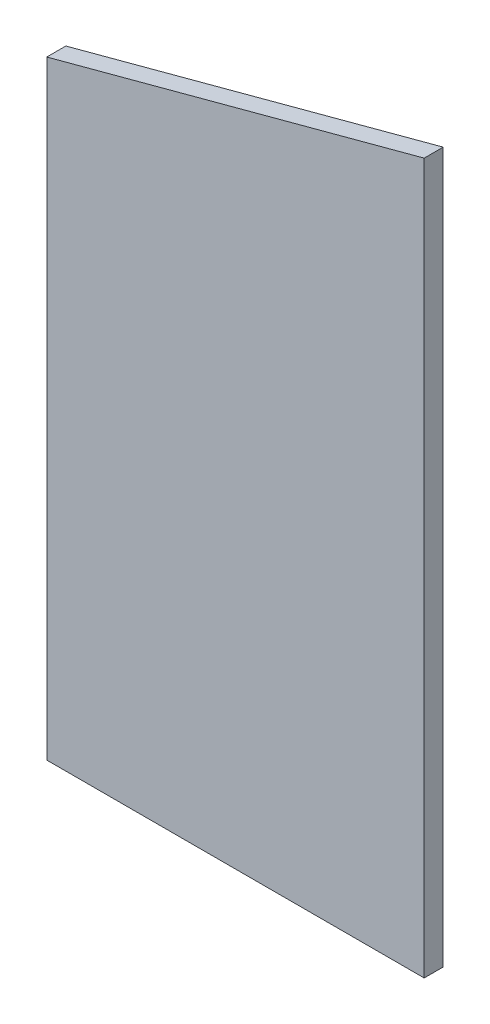
ISO-10303-21;
HEADER;
FILE_DESCRIPTION(('STEP AP214'),'2;1');
FILE_NAME('part.step','',(''),(''),'','','');
FILE_SCHEMA(('AUTOMOTIVE_DESIGN { 1 0 10303 214 1 1 1 1 }'));
ENDSEC;
DATA;
#1=APPLICATION_CONTEXT('core data for automotive mechanical design processes');
#2=APPLICATION_PROTOCOL_DEFINITION('international standard','automotive_design',2000,#1);
#3=PRODUCT_CONTEXT('',#1,'mechanical');
#4=PRODUCT('Part','Part','',(#3));
#5=PRODUCT_RELATED_PRODUCT_CATEGORY('part','',(#4));
#6=PRODUCT_DEFINITION_FORMATION('','',#4);
#7=PRODUCT_DEFINITION_CONTEXT('part definition',#1,'design');
#8=PRODUCT_DEFINITION('design','',#6,#7);
#9=PRODUCT_DEFINITION_SHAPE('','',#8);
#10=(LENGTH_UNIT() NAMED_UNIT(*) SI_UNIT(.MILLI.,.METRE.));
#11=(NAMED_UNIT(*) PLANE_ANGLE_UNIT() SI_UNIT($,.RADIAN.));
#12=(NAMED_UNIT(*) SI_UNIT($,.STERADIAN.) SOLID_ANGLE_UNIT());
#13=UNCERTAINTY_MEASURE_WITH_UNIT(LENGTH_MEASURE(1.E-05),#10,'distance_accuracy_value','');
#14=(GEOMETRIC_REPRESENTATION_CONTEXT(3) GLOBAL_UNCERTAINTY_ASSIGNED_CONTEXT((#13)) GLOBAL_UNIT_ASSIGNED_CONTEXT((#10,
#11,#12)) REPRESENTATION_CONTEXT('',''));
#15=CARTESIAN_POINT('',(0.,0.,0.));
#16=DIRECTION('',(0.,0.,1.));
#17=DIRECTION('',(1.,0.,0.));
#18=AXIS2_PLACEMENT_3D('',#15,#16,#17);
#19=CARTESIAN_POINT('',(0.,0.,-11.90625));
#20=DIRECTION('',(0.,0.,-1.));
#21=DIRECTION('',(-1.,0.,0.));
#22=AXIS2_PLACEMENT_3D('',#19,#20,#21);
#23=PLANE('',#22);
#24=DIRECTION('',(1.,0.,0.));
#25=VECTOR('',#24,1.);
#26=CARTESIAN_POINT('',(-583.900187924995,11.90625,-11.90625));
#27=LINE('',#26,#25);
#28=CARTESIAN_POINT('',(-819.830594651005,11.90625,-11.90625));
#29=VERTEX_POINT('',#28);
#30=CARTESIAN_POINT('',(-583.900187924995,11.90625,-11.90625));
#31=VERTEX_POINT('',#30);
#32=EDGE_CURVE('E36',#29,#31,#27,.T.);
#33=ORIENTED_EDGE('',*,*,#32,.F.);
#34=DIRECTION('',(0.,-1.,0.));
#35=VECTOR('',#34,1.);
#36=CARTESIAN_POINT('',(-819.830594651005,11.90625,-11.90625));
#37=LINE('',#36,#35);
#38=CARTESIAN_POINT('',(-819.830594651005,392.599672186086,-11.90625));
#39=VERTEX_POINT('',#38);
#40=EDGE_CURVE('E60',#39,#29,#37,.T.);
#41=ORIENTED_EDGE('',*,*,#40,.F.);
#42=DIRECTION('',(-0.965925826289068,-0.258819045102522,0.));
#43=VECTOR('',#42,1.);
#44=CARTESIAN_POINT('',(-819.830594651005,392.599672186086,-11.90625));
#45=LINE('',#44,#43);
#46=CARTESIAN_POINT('',(-583.900187924995,455.817034138268,-11.90625));
#47=VERTEX_POINT('',#46);
#48=EDGE_CURVE('E80',#47,#39,#45,.T.);
#49=ORIENTED_EDGE('',*,*,#48,.F.);
#50=DIRECTION('',(0.,1.,0.));
#51=VECTOR('',#50,1.);
#52=CARTESIAN_POINT('',(-583.900187924995,455.817034138267,-11.90625));
#53=LINE('',#52,#51);
#54=EDGE_CURVE('E65',#31,#47,#53,.T.);
#55=ORIENTED_EDGE('',*,*,#54,.F.);
#56=EDGE_LOOP('',(#33,#41,#49,#55));
#57=FACE_BOUND('',#56,.T.);
#58=ADVANCED_FACE('F28',(#57),#23,.T.);
#59=CARTESIAN_POINT('',(0.,0.,0.));
#60=DIRECTION('',(0.,0.,-1.));
#61=DIRECTION('',(-1.,0.,0.));
#62=AXIS2_PLACEMENT_3D('',#59,#60,#61);
#63=PLANE('',#62);
#64=DIRECTION('',(1.,0.,0.));
#65=VECTOR('',#64,1.);
#66=CARTESIAN_POINT('',(-583.900187924995,11.90625,0.));
#67=LINE('',#66,#65);
#68=CARTESIAN_POINT('',(-819.830594651005,11.9062499999999,0.));
#69=VERTEX_POINT('',#68);
#70=CARTESIAN_POINT('',(-583.900187924995,11.90625,0.));
#71=VERTEX_POINT('',#70);
#72=EDGE_CURVE('E70',#69,#71,#67,.T.);
#73=ORIENTED_EDGE('',*,*,#72,.T.);
#74=DIRECTION('',(0.,1.,0.));
#75=VECTOR('',#74,1.);
#76=CARTESIAN_POINT('',(-583.900187924995,455.817034138268,0.));
#77=LINE('',#76,#75);
#78=CARTESIAN_POINT('',(-583.900187924995,455.817034138268,0.));
#79=VERTEX_POINT('',#78);
#80=EDGE_CURVE('E94',#71,#79,#77,.T.);
#81=ORIENTED_EDGE('',*,*,#80,.T.);
#82=DIRECTION('',(-0.965925826289068,-0.258819045102523,0.));
#83=VECTOR('',#82,1.);
#84=CARTESIAN_POINT('',(-819.830594651005,392.599672186086,0.));
#85=LINE('',#84,#83);
#86=CARTESIAN_POINT('',(-819.830594651005,392.599672186086,0.));
#87=VERTEX_POINT('',#86);
#88=EDGE_CURVE('E90',#79,#87,#85,.T.);
#89=ORIENTED_EDGE('',*,*,#88,.T.);
#90=DIRECTION('',(0.,-1.,0.));
#91=VECTOR('',#90,1.);
#92=CARTESIAN_POINT('',(-819.830594651005,11.9062499999999,0.));
#93=LINE('',#92,#91);
#94=EDGE_CURVE('E89',#87,#69,#93,.T.);
#95=ORIENTED_EDGE('',*,*,#94,.T.);
#96=EDGE_LOOP('',(#73,#81,#89,#95));
#97=FACE_BOUND('',#96,.T.);
#98=ADVANCED_FACE('F99',(#97),#63,.F.);
#99=CARTESIAN_POINT('',(-583.900187924995,455.817034138268,-514.618832985698));
#100=DIRECTION('',(1.,0.,0.));
#101=DIRECTION('',(0.,0.,-1.));
#102=AXIS2_PLACEMENT_3D('',#99,#100,#101);
#103=PLANE('',#102);
#104=DIRECTION('',(0.,0.,1.));
#105=VECTOR('',#104,1.);
#106=CARTESIAN_POINT('',(-583.900187924995,11.90625,-514.618832985698));
#107=LINE('',#106,#105);
#108=EDGE_CURVE('E11',#31,#71,#107,.T.);
#109=ORIENTED_EDGE('',*,*,#108,.F.);
#110=ORIENTED_EDGE('',*,*,#54,.T.);
#111=DIRECTION('',(0.,0.,1.));
#112=VECTOR('',#111,1.);
#113=CARTESIAN_POINT('',(-583.900187924995,455.817034138268,-514.618832985698));
#114=LINE('',#113,#112);
#115=EDGE_CURVE('E84',#47,#79,#114,.T.);
#116=ORIENTED_EDGE('',*,*,#115,.T.);
#117=ORIENTED_EDGE('',*,*,#80,.F.);
#118=EDGE_LOOP('',(#109,#110,#116,#117));
#119=FACE_BOUND('',#118,.T.);
#120=ADVANCED_FACE('F103',(#119),#103,.T.);
#121=CARTESIAN_POINT('',(-819.830594651005,392.599672186086,-514.618832985698));
#122=DIRECTION('',(-0.258819045102523,0.965925826289068,0.));
#123=DIRECTION('',(-0.965925826289068,-0.258819045102523,0.));
#124=AXIS2_PLACEMENT_3D('',#121,#122,#123);
#125=PLANE('',#124);
#126=ORIENTED_EDGE('',*,*,#115,.F.);
#127=ORIENTED_EDGE('',*,*,#48,.T.);
#128=DIRECTION('',(0.,0.,1.));
#129=VECTOR('',#128,1.);
#130=CARTESIAN_POINT('',(-819.830594651005,392.599672186086,-514.618832985698));
#131=LINE('',#130,#129);
#132=EDGE_CURVE('E77',#39,#87,#131,.T.);
#133=ORIENTED_EDGE('',*,*,#132,.T.);
#134=ORIENTED_EDGE('',*,*,#88,.F.);
#135=EDGE_LOOP('',(#126,#127,#133,#134));
#136=FACE_BOUND('',#135,.T.);
#137=ADVANCED_FACE('F101',(#136),#125,.T.);
#138=CARTESIAN_POINT('',(-819.830594651005,11.9062499999999,-514.618832985698));
#139=DIRECTION('',(-1.,0.,0.));
#140=DIRECTION('',(0.,0.,1.));
#141=AXIS2_PLACEMENT_3D('',#138,#139,#140);
#142=PLANE('',#141);
#143=ORIENTED_EDGE('',*,*,#132,.F.);
#144=ORIENTED_EDGE('',*,*,#40,.T.);
#145=DIRECTION('',(0.,0.,1.));
#146=VECTOR('',#145,1.);
#147=CARTESIAN_POINT('',(-819.830594651005,11.9062499999999,-514.618832985698));
#148=LINE('',#147,#146);
#149=EDGE_CURVE('E66',#29,#69,#148,.T.);
#150=ORIENTED_EDGE('',*,*,#149,.T.);
#151=ORIENTED_EDGE('',*,*,#94,.F.);
#152=EDGE_LOOP('',(#143,#144,#150,#151));
#153=FACE_BOUND('',#152,.T.);
#154=ADVANCED_FACE('F75',(#153),#142,.T.);
#155=CARTESIAN_POINT('',(-583.900187924995,11.90625,-514.618832985698));
#156=DIRECTION('',(0.,-1.,0.));
#157=DIRECTION('',(1.,0.,0.));
#158=AXIS2_PLACEMENT_3D('',#155,#156,#157);
#159=PLANE('',#158);
#160=ORIENTED_EDGE('',*,*,#149,.F.);
#161=ORIENTED_EDGE('',*,*,#32,.T.);
#162=ORIENTED_EDGE('',*,*,#108,.T.);
#163=ORIENTED_EDGE('',*,*,#72,.F.);
#164=EDGE_LOOP('',(#160,#161,#162,#163));
#165=FACE_BOUND('',#164,.T.);
#166=ADVANCED_FACE('F68',(#165),#159,.T.);
#167=CLOSED_SHELL('',(#58,#98,#120,#137,#154,#166));
#168=MANIFOLD_SOLID_BREP('B2',#167);
#169=ADVANCED_BREP_SHAPE_REPRESENTATION('',(#18,#168),#14);
#170=SHAPE_DEFINITION_REPRESENTATION(#9,#169);
ENDSEC;
END-ISO-10303-21;
